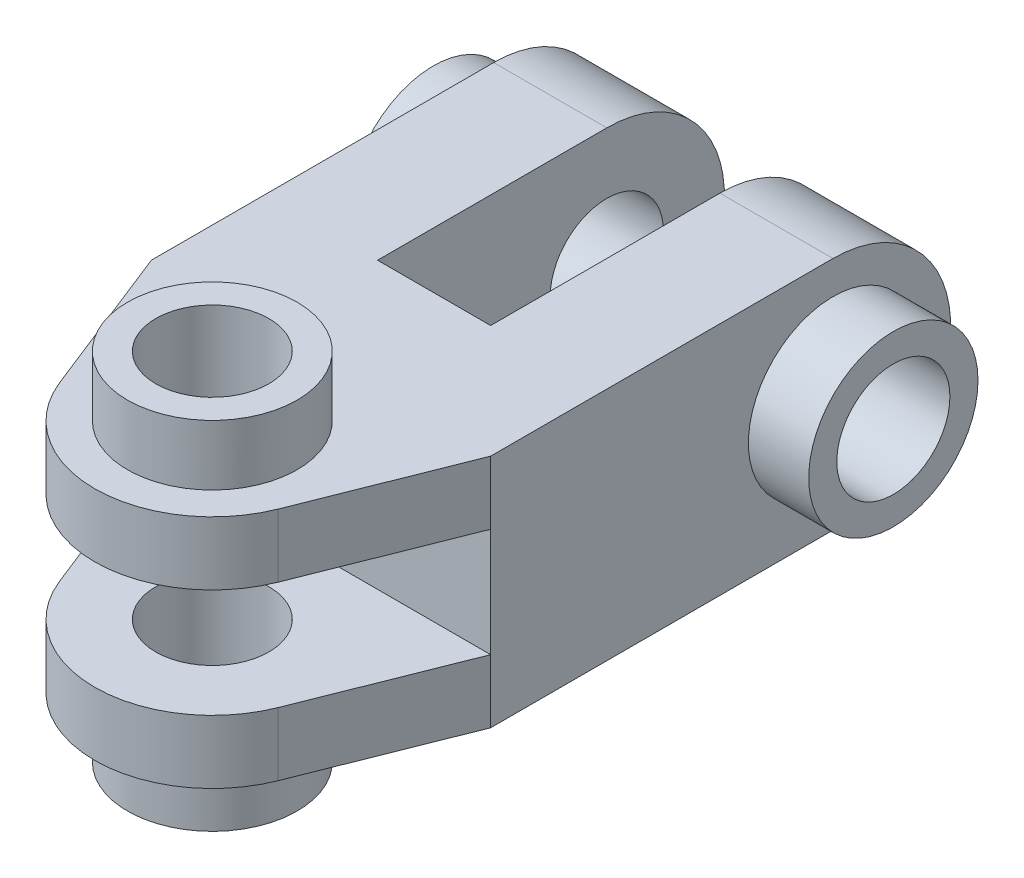
ISO-10303-21;
HEADER;
FILE_DESCRIPTION(('STEP AP214'),'2;1');
FILE_NAME('part.step','',(''),(''),'','','');
FILE_SCHEMA(('AUTOMOTIVE_DESIGN { 1 0 10303 214 1 1 1 1 }'));
ENDSEC;
DATA;
#1=APPLICATION_CONTEXT('core data for automotive mechanical design processes');
#2=APPLICATION_PROTOCOL_DEFINITION('international standard','automotive_design',2000,#1);
#3=PRODUCT_CONTEXT('',#1,'mechanical');
#4=PRODUCT('Part','Part','',(#3));
#5=PRODUCT_RELATED_PRODUCT_CATEGORY('part','',(#4));
#6=PRODUCT_DEFINITION_FORMATION('','',#4);
#7=PRODUCT_DEFINITION_CONTEXT('part definition',#1,'design');
#8=PRODUCT_DEFINITION('design','',#6,#7);
#9=PRODUCT_DEFINITION_SHAPE('','',#8);
#10=(LENGTH_UNIT() NAMED_UNIT(*) SI_UNIT(.MILLI.,.METRE.));
#11=(NAMED_UNIT(*) PLANE_ANGLE_UNIT() SI_UNIT($,.RADIAN.));
#12=(NAMED_UNIT(*) SI_UNIT($,.STERADIAN.) SOLID_ANGLE_UNIT());
#13=UNCERTAINTY_MEASURE_WITH_UNIT(LENGTH_MEASURE(1.E-05),#10,'distance_accuracy_value','');
#14=(GEOMETRIC_REPRESENTATION_CONTEXT(3) GLOBAL_UNCERTAINTY_ASSIGNED_CONTEXT((#13)) GLOBAL_UNIT_ASSIGNED_CONTEXT((#10,
#11,#12)) REPRESENTATION_CONTEXT('',''));
#15=CARTESIAN_POINT('',(0.,0.,0.));
#16=DIRECTION('',(0.,0.,1.));
#17=DIRECTION('',(1.,0.,0.));
#18=AXIS2_PLACEMENT_3D('',#15,#16,#17);
#19=CARTESIAN_POINT('',(28.575,0.,0.));
#20=DIRECTION('',(1.,0.,0.));
#21=DIRECTION('',(0.,0.,-1.));
#22=AXIS2_PLACEMENT_3D('',#19,#20,#21);
#23=PLANE('',#22);
#24=DIRECTION('',(0.,1.,0.));
#25=VECTOR('',#24,1.);
#26=CARTESIAN_POINT('',(28.575,-19.812,57.658));
#27=LINE('',#26,#25);
#28=CARTESIAN_POINT('',(28.575,-19.812,57.658));
#29=VERTEX_POINT('',#28);
#30=CARTESIAN_POINT('',(28.575,-9.144,57.658));
#31=VERTEX_POINT('',#30);
#32=EDGE_CURVE('E268',#29,#31,#27,.T.);
#33=ORIENTED_EDGE('',*,*,#32,.F.);
#34=DIRECTION('',(0.,0.,1.));
#35=VECTOR('',#34,1.);
#36=CARTESIAN_POINT('',(28.575,-19.812,0.));
#37=LINE('',#36,#35);
#38=CARTESIAN_POINT('',(28.575,-19.812,0.));
#39=VERTEX_POINT('',#38);
#40=EDGE_CURVE('E223',#39,#29,#37,.T.);
#41=ORIENTED_EDGE('',*,*,#40,.F.);
#42=CARTESIAN_POINT('',(28.575,0.,0.));
#43=DIRECTION('',(1.,0.,0.));
#44=DIRECTION('',(0.,0.,-1.));
#45=AXIS2_PLACEMENT_3D('',#42,#43,#44);
#46=CIRCLE('',#45,19.812);
#47=CARTESIAN_POINT('',(28.575,19.812,0.));
#48=VERTEX_POINT('',#47);
#49=EDGE_CURVE('E308',#39,#48,#46,.T.);
#50=ORIENTED_EDGE('',*,*,#49,.T.);
#51=DIRECTION('',(0.,0.,1.));
#52=VECTOR('',#51,1.);
#53=CARTESIAN_POINT('',(28.575,19.812,0.));
#54=LINE('',#53,#52);
#55=CARTESIAN_POINT('',(28.575,19.812,57.658));
#56=VERTEX_POINT('',#55);
#57=EDGE_CURVE('E310',#48,#56,#54,.T.);
#58=ORIENTED_EDGE('',*,*,#57,.T.);
#59=DIRECTION('',(0.,1.,0.));
#60=VECTOR('',#59,1.);
#61=CARTESIAN_POINT('',(28.575,0.,57.658));
#62=LINE('',#61,#60);
#63=CARTESIAN_POINT('',(28.575,9.144,57.658));
#64=VERTEX_POINT('',#63);
#65=EDGE_CURVE('E214',#64,#56,#62,.T.);
#66=ORIENTED_EDGE('',*,*,#65,.F.);
#67=DIRECTION('',(0.,-1.,0.));
#68=VECTOR('',#67,1.);
#69=CARTESIAN_POINT('',(28.575,0.,57.658));
#70=LINE('',#69,#68);
#71=EDGE_CURVE('E233',#64,#31,#70,.T.);
#72=ORIENTED_EDGE('',*,*,#71,.T.);
#73=EDGE_LOOP('',(#33,#41,#50,#58,#66,#72));
#74=FACE_BOUND('',#73,.T.);
#75=CARTESIAN_POINT('',(28.575,0.,0.));
#76=DIRECTION('',(1.,0.,0.));
#77=DIRECTION('',(0.,0.,-1.));
#78=AXIS2_PLACEMENT_3D('',#75,#76,#77);
#79=CIRCLE('',#78,14.25575);
#80=CARTESIAN_POINT('',(28.575,0.,-14.25575));
#81=VERTEX_POINT('',#80);
#82=EDGE_CURVE('E345',#81,#81,#79,.T.);
#83=ORIENTED_EDGE('',*,*,#82,.F.);
#84=EDGE_LOOP('',(#83));
#85=FACE_BOUND('',#84,.T.);
#86=ADVANCED_FACE('F89',(#74,#85),#23,.T.);
#87=CARTESIAN_POINT('',(28.575,-19.812,0.));
#88=DIRECTION('',(0.,-1.,0.));
#89=DIRECTION('',(0.,0.,-1.));
#90=AXIS2_PLACEMENT_3D('',#87,#88,#89);
#91=PLANE('',#90);
#92=CARTESIAN_POINT('',(-0.0154327730859556,-19.812,75.946));
#93=DIRECTION('',(0.,1.,0.));
#94=DIRECTION('',(0.,0.,1.));
#95=AXIS2_PLACEMENT_3D('',#92,#93,#94);
#96=CIRCLE('',#95,19.812);
#97=CARTESIAN_POINT('',(-18.4335789109401,-19.812,83.2458107403309));
#98=VERTEX_POINT('',#97);
#99=CARTESIAN_POINT('',(18.3950993167603,-19.812,83.2649925651515));
#100=VERTEX_POINT('',#99);
#101=EDGE_CURVE('E264',#98,#100,#96,.T.);
#102=ORIENTED_EDGE('',*,*,#101,.F.);
#103=DIRECTION('',(0.368454004660351,0.,0.929645979096209));
#104=VECTOR('',#103,1.);
#105=CARTESIAN_POINT('',(-44.4454026442376,-19.812,17.6154008743541));
#106=LINE('',#105,#104);
#107=CARTESIAN_POINT('',(-28.575,-19.812,57.6579999999999));
#108=VERTEX_POINT('',#107);
#109=EDGE_CURVE('E260',#108,#98,#106,.T.);
#110=ORIENTED_EDGE('',*,*,#109,.F.);
#111=DIRECTION('',(0.,0.,1.));
#112=VECTOR('',#111,1.);
#113=CARTESIAN_POINT('',(-28.575,-19.812,0.));
#114=LINE('',#113,#112);
#115=CARTESIAN_POINT('',(-28.575,-19.812,0.));
#116=VERTEX_POINT('',#115);
#117=EDGE_CURVE('E225',#116,#108,#114,.T.);
#118=ORIENTED_EDGE('',*,*,#117,.F.);
#119=DIRECTION('',(-1.,0.,0.));
#120=VECTOR('',#119,1.);
#121=CARTESIAN_POINT('',(28.575,-19.812,0.));
#122=LINE('',#121,#120);
#123=CARTESIAN_POINT('',(-9.52499999999999,-19.812,0.));
#124=VERTEX_POINT('',#123);
#125=EDGE_CURVE('E239',#124,#116,#122,.T.);
#126=ORIENTED_EDGE('',*,*,#125,.F.);
#127=DIRECTION('',(0.,0.,1.));
#128=VECTOR('',#127,1.);
#129=CARTESIAN_POINT('',(-9.52499999999999,-19.812,0.));
#130=LINE('',#129,#128);
#131=CARTESIAN_POINT('',(-9.52499999999999,-19.812,38.608));
#132=VERTEX_POINT('',#131);
#133=EDGE_CURVE('E290',#124,#132,#130,.T.);
#134=ORIENTED_EDGE('',*,*,#133,.T.);
#135=DIRECTION('',(1.,0.,0.));
#136=VECTOR('',#135,1.);
#137=CARTESIAN_POINT('',(0.,-19.812,38.608));
#138=LINE('',#137,#136);
#139=CARTESIAN_POINT('',(9.52500000000001,-19.812,38.608));
#140=VERTEX_POINT('',#139);
#141=EDGE_CURVE('E293',#132,#140,#138,.T.);
#142=ORIENTED_EDGE('',*,*,#141,.T.);
#143=DIRECTION('',(0.,0.,1.));
#144=VECTOR('',#143,1.);
#145=CARTESIAN_POINT('',(9.525,-19.812,0.));
#146=LINE('',#145,#144);
#147=CARTESIAN_POINT('',(9.525,-19.812,0.));
#148=VERTEX_POINT('',#147);
#149=EDGE_CURVE('E288',#148,#140,#146,.T.);
#150=ORIENTED_EDGE('',*,*,#149,.F.);
#151=EDGE_CURVE('E240',#39,#148,#122,.T.);
#152=ORIENTED_EDGE('',*,*,#151,.F.);
#153=ORIENTED_EDGE('',*,*,#40,.T.);
#154=DIRECTION('',(-0.369422196908513,0.,0.929261664135182));
#155=VECTOR('',#154,1.);
#156=CARTESIAN_POINT('',(44.4686991116195,-19.812,17.6782548484518));
#157=LINE('',#156,#155);
#158=EDGE_CURVE('E105',#29,#100,#157,.T.);
#159=ORIENTED_EDGE('',*,*,#158,.T.);
#160=EDGE_LOOP('',(#102,#110,#118,#126,#134,#142,#150,#152,#153,#159));
#161=FACE_BOUND('',#160,.T.);
#162=CARTESIAN_POINT('',(-0.0154327730859556,-19.812,75.946));
#163=DIRECTION('',(0.,-1.,0.));
#164=DIRECTION('',(0.,0.,-1.));
#165=AXIS2_PLACEMENT_3D('',#162,#163,#164);
#166=CIRCLE('',#165,14.2875);
#167=CARTESIAN_POINT('',(-0.0154327730859556,-19.812,61.6585));
#168=VERTEX_POINT('',#167);
#169=EDGE_CURVE('E334',#168,#168,#166,.T.);
#170=ORIENTED_EDGE('',*,*,#169,.F.);
#171=EDGE_LOOP('',(#170));
#172=FACE_BOUND('',#171,.T.);
#173=ADVANCED_FACE('F91',(#161,#172),#91,.T.);
#174=CARTESIAN_POINT('',(28.575,19.812,0.));
#175=DIRECTION('',(0.,-1.,0.));
#176=DIRECTION('',(0.,0.,-1.));
#177=AXIS2_PLACEMENT_3D('',#174,#175,#176);
#178=PLANE('',#177);
#179=DIRECTION('',(0.368454004660351,0.,0.929645979096209));
#180=VECTOR('',#179,1.);
#181=CARTESIAN_POINT('',(-44.4454026442376,19.812,17.6154008743541));
#182=LINE('',#181,#180);
#183=CARTESIAN_POINT('',(-28.575,19.812,57.6579999999999));
#184=VERTEX_POINT('',#183);
#185=CARTESIAN_POINT('',(-18.4335789109401,19.812,83.2458107403309));
#186=VERTEX_POINT('',#185);
#187=EDGE_CURVE('E192',#184,#186,#182,.T.);
#188=ORIENTED_EDGE('',*,*,#187,.T.);
#189=CARTESIAN_POINT('',(-0.0154327730859556,19.812,75.946));
#190=DIRECTION('',(0.,1.,0.));
#191=DIRECTION('',(0.,0.,1.));
#192=AXIS2_PLACEMENT_3D('',#189,#190,#191);
#193=CIRCLE('',#192,19.812);
#194=CARTESIAN_POINT('',(18.3950993167603,19.812,83.2649925651515));
#195=VERTEX_POINT('',#194);
#196=EDGE_CURVE('E255',#186,#195,#193,.T.);
#197=ORIENTED_EDGE('',*,*,#196,.T.);
#198=DIRECTION('',(-0.369422196908513,0.,0.929261664135182));
#199=VECTOR('',#198,1.);
#200=CARTESIAN_POINT('',(44.4686991116195,19.812,17.6782548484518));
#201=LINE('',#200,#199);
#202=EDGE_CURVE('E266',#56,#195,#201,.T.);
#203=ORIENTED_EDGE('',*,*,#202,.F.);
#204=ORIENTED_EDGE('',*,*,#57,.F.);
#205=DIRECTION('',(-1.,0.,0.));
#206=VECTOR('',#205,1.);
#207=CARTESIAN_POINT('',(28.575,19.812,0.));
#208=LINE('',#207,#206);
#209=CARTESIAN_POINT('',(9.525,19.812,0.));
#210=VERTEX_POINT('',#209);
#211=EDGE_CURVE('E236',#48,#210,#208,.T.);
#212=ORIENTED_EDGE('',*,*,#211,.T.);
#213=DIRECTION('',(0.,0.,-1.));
#214=VECTOR('',#213,1.);
#215=CARTESIAN_POINT('',(9.525,19.812,0.));
#216=LINE('',#215,#214);
#217=CARTESIAN_POINT('',(9.52500000000001,19.812,38.608));
#218=VERTEX_POINT('',#217);
#219=EDGE_CURVE('E245',#218,#210,#216,.T.);
#220=ORIENTED_EDGE('',*,*,#219,.F.);
#221=DIRECTION('',(1.,0.,0.));
#222=VECTOR('',#221,1.);
#223=CARTESIAN_POINT('',(0.,19.812,38.608));
#224=LINE('',#223,#222);
#225=CARTESIAN_POINT('',(-9.52499999999999,19.812,38.608));
#226=VERTEX_POINT('',#225);
#227=EDGE_CURVE('E287',#226,#218,#224,.T.);
#228=ORIENTED_EDGE('',*,*,#227,.F.);
#229=DIRECTION('',(0.,0.,-1.));
#230=VECTOR('',#229,1.);
#231=CARTESIAN_POINT('',(-9.525,19.812,0.));
#232=LINE('',#231,#230);
#233=CARTESIAN_POINT('',(-9.525,19.812,0.));
#234=VERTEX_POINT('',#233);
#235=EDGE_CURVE('E243',#226,#234,#232,.T.);
#236=ORIENTED_EDGE('',*,*,#235,.T.);
#237=CARTESIAN_POINT('',(-28.575,19.812,0.));
#238=VERTEX_POINT('',#237);
#239=EDGE_CURVE('E219',#234,#238,#208,.T.);
#240=ORIENTED_EDGE('',*,*,#239,.T.);
#241=DIRECTION('',(0.,0.,1.));
#242=VECTOR('',#241,1.);
#243=CARTESIAN_POINT('',(-28.575,19.812,0.));
#244=LINE('',#243,#242);
#245=EDGE_CURVE('E210',#238,#184,#244,.T.);
#246=ORIENTED_EDGE('',*,*,#245,.T.);
#247=EDGE_LOOP('',(#188,#197,#203,#204,#212,#220,#228,#236,#240,#246));
#248=FACE_BOUND('',#247,.T.);
#249=CARTESIAN_POINT('',(-0.0154327730859556,19.812,75.946));
#250=DIRECTION('',(0.,-1.,0.));
#251=DIRECTION('',(0.,0.,-1.));
#252=AXIS2_PLACEMENT_3D('',#249,#250,#251);
#253=CIRCLE('',#252,14.2875);
#254=CARTESIAN_POINT('',(-0.0154327730859556,19.812,61.6585));
#255=VERTEX_POINT('',#254);
#256=EDGE_CURVE('E12',#255,#255,#253,.F.);
#257=ORIENTED_EDGE('',*,*,#256,.F.);
#258=EDGE_LOOP('',(#257));
#259=FACE_BOUND('',#258,.T.);
#260=ADVANCED_FACE('F216',(#248,#259),#178,.F.);
#261=CARTESIAN_POINT('',(28.575,9.144,0.));
#262=DIRECTION('',(0.,1.,0.));
#263=DIRECTION('',(0.,0.,1.));
#264=AXIS2_PLACEMENT_3D('',#261,#262,#263);
#265=PLANE('',#264);
#266=CARTESIAN_POINT('',(-0.0154327730859556,9.144,75.946));
#267=DIRECTION('',(0.,1.,0.));
#268=DIRECTION('',(0.,0.,1.));
#269=AXIS2_PLACEMENT_3D('',#266,#267,#268);
#270=CIRCLE('',#269,9.525);
#271=CARTESIAN_POINT('',(-0.0154327730859556,9.144,85.471));
#272=VERTEX_POINT('',#271);
#273=EDGE_CURVE('E250',#272,#272,#270,.T.);
#274=ORIENTED_EDGE('',*,*,#273,.T.);
#275=EDGE_LOOP('',(#274));
#276=FACE_BOUND('',#275,.T.);
#277=CARTESIAN_POINT('',(-0.0154327730859556,9.144,75.946));
#278=DIRECTION('',(0.,1.,0.));
#279=DIRECTION('',(0.,0.,1.));
#280=AXIS2_PLACEMENT_3D('',#277,#278,#279);
#281=CIRCLE('',#280,19.812);
#282=CARTESIAN_POINT('',(-18.4335789109401,9.144,83.2458107403309));
#283=VERTEX_POINT('',#282);
#284=CARTESIAN_POINT('',(18.3950993167603,9.144,83.2649925651515));
#285=VERTEX_POINT('',#284);
#286=EDGE_CURVE('E285',#283,#285,#281,.T.);
#287=ORIENTED_EDGE('',*,*,#286,.F.);
#288=DIRECTION('',(0.368454004660351,0.,0.92964597909621));
#289=VECTOR('',#288,1.);
#290=CARTESIAN_POINT('',(-40.5661076915392,9.144,27.4032465997078));
#291=LINE('',#290,#289);
#292=CARTESIAN_POINT('',(-28.575,9.144,57.6579999999999));
#293=VERTEX_POINT('',#292);
#294=EDGE_CURVE('E251',#293,#283,#291,.T.);
#295=ORIENTED_EDGE('',*,*,#294,.F.);
#296=DIRECTION('',(-1.,0.,0.));
#297=VECTOR('',#296,1.);
#298=CARTESIAN_POINT('',(28.575,9.144,57.658));
#299=LINE('',#298,#297);
#300=EDGE_CURVE('E232',#64,#293,#299,.T.);
#301=ORIENTED_EDGE('',*,*,#300,.F.);
#302=DIRECTION('',(-0.369422196908513,0.,0.929261664135182));
#303=VECTOR('',#302,1.);
#304=CARTESIAN_POINT('',(48.3684082162955,9.144,7.86874637121282));
#305=LINE('',#304,#303);
#306=EDGE_CURVE('E279',#64,#285,#305,.T.);
#307=ORIENTED_EDGE('',*,*,#306,.T.);
#308=EDGE_LOOP('',(#287,#295,#301,#307));
#309=FACE_BOUND('',#308,.T.);
#310=ADVANCED_FACE('F403',(#276,#309),#265,.F.);
#311=CARTESIAN_POINT('',(28.575,-9.144,0.));
#312=DIRECTION('',(0.,1.,0.));
#313=DIRECTION('',(0.,0.,1.));
#314=AXIS2_PLACEMENT_3D('',#311,#312,#313);
#315=PLANE('',#314);
#316=CARTESIAN_POINT('',(-0.0154327730859556,-9.144,75.946));
#317=DIRECTION('',(0.,1.,0.));
#318=DIRECTION('',(0.,0.,1.));
#319=AXIS2_PLACEMENT_3D('',#316,#317,#318);
#320=CIRCLE('',#319,9.525);
#321=CARTESIAN_POINT('',(-0.0154327730859556,-9.144,85.471));
#322=VERTEX_POINT('',#321);
#323=EDGE_CURVE('E248',#322,#322,#320,.T.);
#324=ORIENTED_EDGE('',*,*,#323,.F.);
#325=EDGE_LOOP('',(#324));
#326=FACE_BOUND('',#325,.T.);
#327=DIRECTION('',(0.368454004660351,0.,0.92964597909621));
#328=VECTOR('',#327,1.);
#329=CARTESIAN_POINT('',(-40.5661076915392,-9.144,27.4032465997078));
#330=LINE('',#329,#328);
#331=CARTESIAN_POINT('',(-28.575,-9.144,57.6579999999999));
#332=VERTEX_POINT('',#331);
#333=CARTESIAN_POINT('',(-18.4335789109401,-9.144,83.2458107403309));
#334=VERTEX_POINT('',#333);
#335=EDGE_CURVE('E257',#332,#334,#330,.T.);
#336=ORIENTED_EDGE('',*,*,#335,.T.);
#337=CARTESIAN_POINT('',(-0.0154327730859556,-9.144,75.946));
#338=DIRECTION('',(0.,1.,0.));
#339=DIRECTION('',(0.,0.,1.));
#340=AXIS2_PLACEMENT_3D('',#337,#338,#339);
#341=CIRCLE('',#340,19.812);
#342=CARTESIAN_POINT('',(18.3950993167603,-9.144,83.2649925651515));
#343=VERTEX_POINT('',#342);
#344=EDGE_CURVE('E282',#334,#343,#341,.T.);
#345=ORIENTED_EDGE('',*,*,#344,.T.);
#346=DIRECTION('',(-0.369422196908513,0.,0.929261664135182));
#347=VECTOR('',#346,1.);
#348=CARTESIAN_POINT('',(48.3684082162955,-9.144,7.86874637121282));
#349=LINE('',#348,#347);
#350=EDGE_CURVE('E275',#31,#343,#349,.T.);
#351=ORIENTED_EDGE('',*,*,#350,.F.);
#352=DIRECTION('',(-1.,0.,0.));
#353=VECTOR('',#352,1.);
#354=CARTESIAN_POINT('',(28.575,-9.144,57.658));
#355=LINE('',#354,#353);
#356=EDGE_CURVE('E229',#31,#332,#355,.T.);
#357=ORIENTED_EDGE('',*,*,#356,.T.);
#358=EDGE_LOOP('',(#336,#345,#351,#357));
#359=FACE_BOUND('',#358,.T.);
#360=ADVANCED_FACE('F399',(#326,#359),#315,.T.);
#361=CARTESIAN_POINT('',(-28.575,0.,0.));
#362=DIRECTION('',(1.,0.,0.));
#363=DIRECTION('',(0.,0.,-1.));
#364=AXIS2_PLACEMENT_3D('',#361,#362,#363);
#365=PLANE('',#364);
#366=CARTESIAN_POINT('',(-28.575,0.,0.));
#367=DIRECTION('',(1.,0.,0.));
#368=DIRECTION('',(0.,0.,-1.));
#369=AXIS2_PLACEMENT_3D('',#366,#367,#368);
#370=CIRCLE('',#369,14.25575);
#371=CARTESIAN_POINT('',(-28.575,0.,-14.25575));
#372=VERTEX_POINT('',#371);
#373=EDGE_CURVE('E355',#372,#372,#370,.T.);
#374=ORIENTED_EDGE('',*,*,#373,.T.);
#375=EDGE_LOOP('',(#374));
#376=FACE_BOUND('',#375,.T.);
#377=DIRECTION('',(0.,-1.,0.));
#378=VECTOR('',#377,1.);
#379=CARTESIAN_POINT('',(-28.575,0.,57.658));
#380=LINE('',#379,#378);
#381=EDGE_CURVE('E98',#184,#293,#380,.T.);
#382=ORIENTED_EDGE('',*,*,#381,.F.);
#383=ORIENTED_EDGE('',*,*,#245,.F.);
#384=CARTESIAN_POINT('',(-28.575,0.,0.));
#385=DIRECTION('',(1.,0.,0.));
#386=DIRECTION('',(0.,0.,-1.));
#387=AXIS2_PLACEMENT_3D('',#384,#385,#386);
#388=CIRCLE('',#387,19.812);
#389=EDGE_CURVE('E221',#116,#238,#388,.T.);
#390=ORIENTED_EDGE('',*,*,#389,.F.);
#391=ORIENTED_EDGE('',*,*,#117,.T.);
#392=DIRECTION('',(0.,1.,0.));
#393=VECTOR('',#392,1.);
#394=CARTESIAN_POINT('',(-28.575,-19.812,57.6579999999999));
#395=LINE('',#394,#393);
#396=EDGE_CURVE('E202',#108,#332,#395,.T.);
#397=ORIENTED_EDGE('',*,*,#396,.T.);
#398=DIRECTION('',(0.,-1.,0.));
#399=VECTOR('',#398,1.);
#400=CARTESIAN_POINT('',(-28.575,0.,57.658));
#401=LINE('',#400,#399);
#402=EDGE_CURVE('E213',#293,#332,#401,.T.);
#403=ORIENTED_EDGE('',*,*,#402,.F.);
#404=EDGE_LOOP('',(#382,#383,#390,#391,#397,#403));
#405=FACE_BOUND('',#404,.T.);
#406=ADVANCED_FACE('F208',(#376,#405),#365,.F.);
#407=CARTESIAN_POINT('',(28.575,0.,0.));
#408=DIRECTION('',(-1.,0.,0.));
#409=DIRECTION('',(0.,0.,1.));
#410=AXIS2_PLACEMENT_3D('',#407,#408,#409);
#411=CYLINDRICAL_SURFACE('',#410,19.812);
#412=CARTESIAN_POINT('',(9.525,0.,0.));
#413=DIRECTION('',(-1.,0.,0.));
#414=DIRECTION('',(0.,0.,1.));
#415=AXIS2_PLACEMENT_3D('',#412,#413,#414);
#416=CIRCLE('',#415,19.812);
#417=EDGE_CURVE('E304',#210,#148,#416,.T.);
#418=ORIENTED_EDGE('',*,*,#417,.F.);
#419=ORIENTED_EDGE('',*,*,#211,.F.);
#420=ORIENTED_EDGE('',*,*,#49,.F.);
#421=ORIENTED_EDGE('',*,*,#151,.T.);
#422=EDGE_LOOP('',(#418,#419,#420,#421));
#423=FACE_BOUND('',#422,.T.);
#424=ADVANCED_FACE('F398',(#423),#411,.T.);
#425=ORIENTED_EDGE('',*,*,#239,.F.);
#426=CARTESIAN_POINT('',(-9.525,0.,0.));
#427=DIRECTION('',(-1.,0.,0.));
#428=DIRECTION('',(0.,0.,1.));
#429=AXIS2_PLACEMENT_3D('',#426,#427,#428);
#430=CIRCLE('',#429,19.812);
#431=EDGE_CURVE('E113',#234,#124,#430,.T.);
#432=ORIENTED_EDGE('',*,*,#431,.T.);
#433=ORIENTED_EDGE('',*,*,#125,.T.);
#434=ORIENTED_EDGE('',*,*,#389,.T.);
#435=EDGE_LOOP('',(#425,#432,#433,#434));
#436=FACE_BOUND('',#435,.T.);
#437=ADVANCED_FACE('F408',(#436),#411,.T.);
#438=CARTESIAN_POINT('',(28.575,0.,57.658));
#439=DIRECTION('',(0.,0.,-1.));
#440=DIRECTION('',(-1.,0.,0.));
#441=AXIS2_PLACEMENT_3D('',#438,#439,#440);
#442=PLANE('',#441);
#443=ORIENTED_EDGE('',*,*,#402,.T.);
#444=ORIENTED_EDGE('',*,*,#356,.F.);
#445=ORIENTED_EDGE('',*,*,#71,.F.);
#446=ORIENTED_EDGE('',*,*,#300,.T.);
#447=EDGE_LOOP('',(#443,#444,#445,#446));
#448=FACE_BOUND('',#447,.T.);
#449=ADVANCED_FACE('F405',(#448),#442,.F.);
#450=CARTESIAN_POINT('',(9.525,-19.812,0.));
#451=DIRECTION('',(-1.,0.,0.));
#452=DIRECTION('',(0.,0.,1.));
#453=AXIS2_PLACEMENT_3D('',#450,#451,#452);
#454=PLANE('',#453);
#455=CARTESIAN_POINT('',(9.525,0.,0.));
#456=DIRECTION('',(-1.,0.,0.));
#457=DIRECTION('',(0.,0.,1.));
#458=AXIS2_PLACEMENT_3D('',#455,#456,#457);
#459=CIRCLE('',#458,9.525);
#460=CARTESIAN_POINT('',(9.525,0.,9.525));
#461=VERTEX_POINT('',#460);
#462=EDGE_CURVE('E342',#461,#461,#459,.T.);
#463=ORIENTED_EDGE('',*,*,#462,.F.);
#464=EDGE_LOOP('',(#463));
#465=FACE_BOUND('',#464,.T.);
#466=ORIENTED_EDGE('',*,*,#417,.T.);
#467=ORIENTED_EDGE('',*,*,#149,.T.);
#468=DIRECTION('',(0.,1.,0.));
#469=VECTOR('',#468,1.);
#470=CARTESIAN_POINT('',(9.52500000000001,-19.812,38.608));
#471=LINE('',#470,#469);
#472=EDGE_CURVE('E299',#140,#218,#471,.T.);
#473=ORIENTED_EDGE('',*,*,#472,.T.);
#474=ORIENTED_EDGE('',*,*,#219,.T.);
#475=EDGE_LOOP('',(#466,#467,#473,#474));
#476=FACE_BOUND('',#475,.T.);
#477=ADVANCED_FACE('F394',(#465,#476),#454,.T.);
#478=CARTESIAN_POINT('',(-9.52499999999999,-19.812,0.));
#479=DIRECTION('',(-1.,0.,0.));
#480=DIRECTION('',(0.,0.,1.));
#481=AXIS2_PLACEMENT_3D('',#478,#479,#480);
#482=PLANE('',#481);
#483=CARTESIAN_POINT('',(-9.525,0.,0.));
#484=DIRECTION('',(-1.,0.,0.));
#485=DIRECTION('',(0.,0.,1.));
#486=AXIS2_PLACEMENT_3D('',#483,#484,#485);
#487=CIRCLE('',#486,9.525);
#488=CARTESIAN_POINT('',(-9.525,0.,9.525));
#489=VERTEX_POINT('',#488);
#490=EDGE_CURVE('E93',#489,#489,#487,.T.);
#491=ORIENTED_EDGE('',*,*,#490,.T.);
#492=EDGE_LOOP('',(#491));
#493=FACE_BOUND('',#492,.T.);
#494=ORIENTED_EDGE('',*,*,#235,.F.);
#495=DIRECTION('',(0.,1.,0.));
#496=VECTOR('',#495,1.);
#497=CARTESIAN_POINT('',(-9.52499999999999,-19.812,38.608));
#498=LINE('',#497,#496);
#499=EDGE_CURVE('E296',#132,#226,#498,.T.);
#500=ORIENTED_EDGE('',*,*,#499,.F.);
#501=ORIENTED_EDGE('',*,*,#133,.F.);
#502=ORIENTED_EDGE('',*,*,#431,.F.);
#503=EDGE_LOOP('',(#494,#500,#501,#502));
#504=FACE_BOUND('',#503,.T.);
#505=ADVANCED_FACE('F436',(#493,#504),#482,.F.);
#506=CARTESIAN_POINT('',(0.,-19.812,38.608));
#507=DIRECTION('',(0.,0.,1.));
#508=DIRECTION('',(0.,-1.,0.));
#509=AXIS2_PLACEMENT_3D('',#506,#507,#508);
#510=PLANE('',#509);
#511=ORIENTED_EDGE('',*,*,#227,.T.);
#512=ORIENTED_EDGE('',*,*,#472,.F.);
#513=ORIENTED_EDGE('',*,*,#141,.F.);
#514=ORIENTED_EDGE('',*,*,#499,.T.);
#515=EDGE_LOOP('',(#511,#512,#513,#514));
#516=FACE_BOUND('',#515,.T.);
#517=ADVANCED_FACE('F435',(#516),#510,.F.);
#518=CARTESIAN_POINT('',(44.4686991116195,-19.812,17.6782548484518));
#519=DIRECTION('',(-0.929261664135182,0.,-0.369422196908513));
#520=DIRECTION('',(-0.369422196908513,0.,0.929261664135182));
#521=AXIS2_PLACEMENT_3D('',#518,#519,#520);
#522=PLANE('',#521);
#523=ORIENTED_EDGE('',*,*,#65,.T.);
#524=ORIENTED_EDGE('',*,*,#202,.T.);
#525=DIRECTION('',(0.,1.,0.));
#526=VECTOR('',#525,1.);
#527=CARTESIAN_POINT('',(18.3950993167603,-19.812,83.2649925651515));
#528=LINE('',#527,#526);
#529=EDGE_CURVE('E276',#285,#195,#528,.T.);
#530=ORIENTED_EDGE('',*,*,#529,.F.);
#531=ORIENTED_EDGE('',*,*,#306,.F.);
#532=EDGE_LOOP('',(#523,#524,#530,#531));
#533=FACE_BOUND('',#532,.T.);
#534=ADVANCED_FACE('F443',(#533),#522,.F.);
#535=CARTESIAN_POINT('',(-0.0154327730859556,-19.812,75.946));
#536=DIRECTION('',(0.,1.,0.));
#537=DIRECTION('',(0.,0.,1.));
#538=AXIS2_PLACEMENT_3D('',#535,#536,#537);
#539=CYLINDRICAL_SURFACE('',#538,19.812);
#540=ORIENTED_EDGE('',*,*,#286,.T.);
#541=ORIENTED_EDGE('',*,*,#529,.T.);
#542=ORIENTED_EDGE('',*,*,#196,.F.);
#543=DIRECTION('',(0.,1.,0.));
#544=VECTOR('',#543,1.);
#545=CARTESIAN_POINT('',(-18.4335789109401,-19.812,83.2458107403309));
#546=LINE('',#545,#544);
#547=EDGE_CURVE('E198',#283,#186,#546,.T.);
#548=ORIENTED_EDGE('',*,*,#547,.F.);
#549=EDGE_LOOP('',(#540,#541,#542,#548));
#550=FACE_BOUND('',#549,.T.);
#551=ADVANCED_FACE('F452',(#550),#539,.T.);
#552=ORIENTED_EDGE('',*,*,#344,.F.);
#553=EDGE_CURVE('E203',#98,#334,#546,.T.);
#554=ORIENTED_EDGE('',*,*,#553,.F.);
#555=ORIENTED_EDGE('',*,*,#101,.T.);
#556=EDGE_CURVE('E272',#100,#343,#528,.T.);
#557=ORIENTED_EDGE('',*,*,#556,.T.);
#558=EDGE_LOOP('',(#552,#554,#555,#557));
#559=FACE_BOUND('',#558,.T.);
#560=ADVANCED_FACE('F448',(#559),#539,.T.);
#561=ORIENTED_EDGE('',*,*,#350,.T.);
#562=ORIENTED_EDGE('',*,*,#556,.F.);
#563=ORIENTED_EDGE('',*,*,#158,.F.);
#564=ORIENTED_EDGE('',*,*,#32,.T.);
#565=EDGE_LOOP('',(#561,#562,#563,#564));
#566=FACE_BOUND('',#565,.T.);
#567=ADVANCED_FACE('F451',(#566),#522,.F.);
#568=CARTESIAN_POINT('',(-0.0154327730859556,-19.812,75.946));
#569=DIRECTION('',(0.,1.,0.));
#570=DIRECTION('',(0.,0.,1.));
#571=AXIS2_PLACEMENT_3D('',#568,#569,#570);
#572=CYLINDRICAL_SURFACE('',#571,9.525);
#573=ORIENTED_EDGE('',*,*,#323,.T.);
#574=EDGE_LOOP('',(#573));
#575=FACE_BOUND('',#574,.T.);
#576=CARTESIAN_POINT('',(-0.0154327730859556,-29.972,75.946));
#577=DIRECTION('',(0.,-1.,0.));
#578=DIRECTION('',(0.,0.,-1.));
#579=AXIS2_PLACEMENT_3D('',#576,#577,#578);
#580=CIRCLE('',#579,9.52500000000001);
#581=CARTESIAN_POINT('',(-0.0154327730859556,-29.972,66.421));
#582=VERTEX_POINT('',#581);
#583=EDGE_CURVE('E337',#582,#582,#580,.T.);
#584=ORIENTED_EDGE('',*,*,#583,.T.);
#585=EDGE_LOOP('',(#584));
#586=FACE_BOUND('',#585,.T.);
#587=ADVANCED_FACE('F456',(#575,#586),#572,.F.);
#588=ORIENTED_EDGE('',*,*,#273,.F.);
#589=EDGE_LOOP('',(#588));
#590=FACE_BOUND('',#589,.T.);
#591=CARTESIAN_POINT('',(-0.0154327730859556,29.972,75.946));
#592=DIRECTION('',(0.,1.,0.));
#593=DIRECTION('',(0.,0.,1.));
#594=AXIS2_PLACEMENT_3D('',#591,#592,#593);
#595=CIRCLE('',#594,9.52500000000001);
#596=CARTESIAN_POINT('',(-0.0154327730859556,29.972,85.471));
#597=VERTEX_POINT('',#596);
#598=EDGE_CURVE('E330',#597,#597,#595,.T.);
#599=ORIENTED_EDGE('',*,*,#598,.T.);
#600=EDGE_LOOP('',(#599));
#601=FACE_BOUND('',#600,.T.);
#602=ADVANCED_FACE('F459',(#590,#601),#572,.F.);
#603=CARTESIAN_POINT('',(-44.4454026442376,-19.812,17.6154008743541));
#604=DIRECTION('',(-0.929645979096209,0.,0.368454004660351));
#605=DIRECTION('',(0.368454004660351,0.,0.92964597909621));
#606=AXIS2_PLACEMENT_3D('',#603,#604,#605);
#607=PLANE('',#606);
#608=ORIENTED_EDGE('',*,*,#396,.F.);
#609=ORIENTED_EDGE('',*,*,#109,.T.);
#610=ORIENTED_EDGE('',*,*,#553,.T.);
#611=ORIENTED_EDGE('',*,*,#335,.F.);
#612=EDGE_LOOP('',(#608,#609,#610,#611));
#613=FACE_BOUND('',#612,.T.);
#614=ADVANCED_FACE('F460',(#613),#607,.T.);
#615=ORIENTED_EDGE('',*,*,#294,.T.);
#616=ORIENTED_EDGE('',*,*,#547,.T.);
#617=ORIENTED_EDGE('',*,*,#187,.F.);
#618=ORIENTED_EDGE('',*,*,#381,.T.);
#619=EDGE_LOOP('',(#615,#616,#617,#618));
#620=FACE_BOUND('',#619,.T.);
#621=ADVANCED_FACE('F195',(#620),#607,.T.);
#622=CARTESIAN_POINT('',(-0.0154327730859556,29.972,75.946));
#623=DIRECTION('',(0.,1.,0.));
#624=DIRECTION('',(0.,0.,1.));
#625=AXIS2_PLACEMENT_3D('',#622,#623,#624);
#626=PLANE('',#625);
#627=CARTESIAN_POINT('',(-0.0154327730859556,29.972,75.946));
#628=DIRECTION('',(0.,1.,0.));
#629=DIRECTION('',(0.,0.,1.));
#630=AXIS2_PLACEMENT_3D('',#627,#628,#629);
#631=CIRCLE('',#630,14.2875);
#632=CARTESIAN_POINT('',(-0.0154327730859556,29.972,90.2335));
#633=VERTEX_POINT('',#632);
#634=EDGE_CURVE('E327',#633,#633,#631,.T.);
#635=ORIENTED_EDGE('',*,*,#634,.T.);
#636=EDGE_LOOP('',(#635));
#637=FACE_BOUND('',#636,.T.);
#638=ORIENTED_EDGE('',*,*,#598,.F.);
#639=EDGE_LOOP('',(#638));
#640=FACE_BOUND('',#639,.T.);
#641=ADVANCED_FACE('F466',(#637,#640),#626,.T.);
#642=CARTESIAN_POINT('',(-0.0154327730859556,29.972,75.946));
#643=DIRECTION('',(0.,-1.,0.));
#644=DIRECTION('',(0.,0.,-1.));
#645=AXIS2_PLACEMENT_3D('',#642,#643,#644);
#646=CYLINDRICAL_SURFACE('',#645,14.2875);
#647=ORIENTED_EDGE('',*,*,#634,.F.);
#648=EDGE_LOOP('',(#647));
#649=FACE_BOUND('',#648,.T.);
#650=ORIENTED_EDGE('',*,*,#256,.T.);
#651=EDGE_LOOP('',(#650));
#652=FACE_BOUND('',#651,.T.);
#653=ADVANCED_FACE('F463',(#649,#652),#646,.T.);
#654=CARTESIAN_POINT('',(-0.0154327730859556,-29.972,75.946));
#655=DIRECTION('',(0.,-1.,0.));
#656=DIRECTION('',(0.,0.,-1.));
#657=AXIS2_PLACEMENT_3D('',#654,#655,#656);
#658=PLANE('',#657);
#659=CARTESIAN_POINT('',(-0.0154327730859556,-29.972,75.946));
#660=DIRECTION('',(0.,-1.,0.));
#661=DIRECTION('',(0.,0.,-1.));
#662=AXIS2_PLACEMENT_3D('',#659,#660,#661);
#663=CIRCLE('',#662,14.2875);
#664=CARTESIAN_POINT('',(-0.0154327730859556,-29.972,61.6585));
#665=VERTEX_POINT('',#664);
#666=EDGE_CURVE('E333',#665,#665,#663,.T.);
#667=ORIENTED_EDGE('',*,*,#666,.T.);
#668=EDGE_LOOP('',(#667));
#669=FACE_BOUND('',#668,.T.);
#670=ORIENTED_EDGE('',*,*,#583,.F.);
#671=EDGE_LOOP('',(#670));
#672=FACE_BOUND('',#671,.T.);
#673=ADVANCED_FACE('F379',(#669,#672),#658,.T.);
#674=CARTESIAN_POINT('',(-0.0154327730859556,-29.972,75.946));
#675=DIRECTION('',(0.,1.,0.));
#676=DIRECTION('',(0.,0.,1.));
#677=AXIS2_PLACEMENT_3D('',#674,#675,#676);
#678=CYLINDRICAL_SURFACE('',#677,14.2875);
#679=ORIENTED_EDGE('',*,*,#666,.F.);
#680=EDGE_LOOP('',(#679));
#681=FACE_BOUND('',#680,.T.);
#682=ORIENTED_EDGE('',*,*,#169,.T.);
#683=EDGE_LOOP('',(#682));
#684=FACE_BOUND('',#683,.T.);
#685=ADVANCED_FACE('F370',(#681,#684),#678,.T.);
#686=CARTESIAN_POINT('',(-28.575,0.,0.));
#687=DIRECTION('',(1.,0.,0.));
#688=DIRECTION('',(0.,0.,-1.));
#689=AXIS2_PLACEMENT_3D('',#686,#687,#688);
#690=CYLINDRICAL_SURFACE('',#689,9.525);
#691=ORIENTED_EDGE('',*,*,#490,.F.);
#692=EDGE_LOOP('',(#691));
#693=FACE_BOUND('',#692,.T.);
#694=CARTESIAN_POINT('',(-38.735,0.,0.));
#695=DIRECTION('',(1.,0.,0.));
#696=DIRECTION('',(0.,0.,-1.));
#697=AXIS2_PLACEMENT_3D('',#694,#695,#696);
#698=CIRCLE('',#697,9.525);
#699=CARTESIAN_POINT('',(-38.735,0.,-9.525));
#700=VERTEX_POINT('',#699);
#701=EDGE_CURVE('E358',#700,#700,#698,.T.);
#702=ORIENTED_EDGE('',*,*,#701,.F.);
#703=EDGE_LOOP('',(#702));
#704=FACE_BOUND('',#703,.T.);
#705=ADVANCED_FACE('F367',(#693,#704),#690,.F.);
#706=ORIENTED_EDGE('',*,*,#462,.T.);
#707=EDGE_LOOP('',(#706));
#708=FACE_BOUND('',#707,.T.);
#709=CARTESIAN_POINT('',(38.735,0.,0.));
#710=DIRECTION('',(1.,0.,0.));
#711=DIRECTION('',(0.,0.,-1.));
#712=AXIS2_PLACEMENT_3D('',#709,#710,#711);
#713=CIRCLE('',#712,9.525);
#714=CARTESIAN_POINT('',(38.735,0.,-9.525));
#715=VERTEX_POINT('',#714);
#716=EDGE_CURVE('E349',#715,#715,#713,.T.);
#717=ORIENTED_EDGE('',*,*,#716,.T.);
#718=EDGE_LOOP('',(#717));
#719=FACE_BOUND('',#718,.T.);
#720=ADVANCED_FACE('F369',(#708,#719),#690,.F.);
#721=CARTESIAN_POINT('',(38.735,0.,0.));
#722=DIRECTION('',(1.,0.,0.));
#723=DIRECTION('',(0.,0.,-1.));
#724=AXIS2_PLACEMENT_3D('',#721,#722,#723);
#725=PLANE('',#724);
#726=CARTESIAN_POINT('',(38.735,0.,0.));
#727=DIRECTION('',(1.,0.,0.));
#728=DIRECTION('',(0.,0.,-1.));
#729=AXIS2_PLACEMENT_3D('',#726,#727,#728);
#730=CIRCLE('',#729,14.25575);
#731=CARTESIAN_POINT('',(38.735,0.,-14.25575));
#732=VERTEX_POINT('',#731);
#733=EDGE_CURVE('E348',#732,#732,#730,.T.);
#734=ORIENTED_EDGE('',*,*,#733,.T.);
#735=EDGE_LOOP('',(#734));
#736=FACE_BOUND('',#735,.T.);
#737=ORIENTED_EDGE('',*,*,#716,.F.);
#738=EDGE_LOOP('',(#737));
#739=FACE_BOUND('',#738,.T.);
#740=ADVANCED_FACE('F377',(#736,#739),#725,.T.);
#741=CARTESIAN_POINT('',(38.735,0.,0.));
#742=DIRECTION('',(-1.,0.,0.));
#743=DIRECTION('',(0.,0.,1.));
#744=AXIS2_PLACEMENT_3D('',#741,#742,#743);
#745=CYLINDRICAL_SURFACE('',#744,14.25575);
#746=ORIENTED_EDGE('',*,*,#733,.F.);
#747=EDGE_LOOP('',(#746));
#748=FACE_BOUND('',#747,.T.);
#749=ORIENTED_EDGE('',*,*,#82,.T.);
#750=EDGE_LOOP('',(#749));
#751=FACE_BOUND('',#750,.T.);
#752=ADVANCED_FACE('F521',(#748,#751),#745,.T.);
#753=CARTESIAN_POINT('',(-38.735,0.,0.));
#754=DIRECTION('',(1.,0.,0.));
#755=DIRECTION('',(0.,0.,-1.));
#756=AXIS2_PLACEMENT_3D('',#753,#754,#755);
#757=CYLINDRICAL_SURFACE('',#756,14.25575);
#758=CARTESIAN_POINT('',(-38.735,0.,0.));
#759=DIRECTION('',(1.,0.,0.));
#760=DIRECTION('',(0.,0.,-1.));
#761=AXIS2_PLACEMENT_3D('',#758,#759,#760);
#762=CIRCLE('',#761,14.25575);
#763=CARTESIAN_POINT('',(-38.735,0.,-14.25575));
#764=VERTEX_POINT('',#763);
#765=EDGE_CURVE('E354',#764,#764,#762,.T.);
#766=ORIENTED_EDGE('',*,*,#765,.T.);
#767=EDGE_LOOP('',(#766));
#768=FACE_BOUND('',#767,.T.);
#769=ORIENTED_EDGE('',*,*,#373,.F.);
#770=EDGE_LOOP('',(#769));
#771=FACE_BOUND('',#770,.T.);
#772=ADVANCED_FACE('F531',(#768,#771),#757,.T.);
#773=CARTESIAN_POINT('',(-38.735,0.,0.));
#774=DIRECTION('',(1.,0.,0.));
#775=DIRECTION('',(0.,0.,-1.));
#776=AXIS2_PLACEMENT_3D('',#773,#774,#775);
#777=PLANE('',#776);
#778=ORIENTED_EDGE('',*,*,#701,.T.);
#779=EDGE_LOOP('',(#778));
#780=FACE_BOUND('',#779,.T.);
#781=ORIENTED_EDGE('',*,*,#765,.F.);
#782=EDGE_LOOP('',(#781));
#783=FACE_BOUND('',#782,.T.);
#784=ADVANCED_FACE('F364',(#780,#783),#777,.F.);
#785=CLOSED_SHELL('',(#86,#173,#260,#310,#360,#406,#424,#437,#449,#477,#505,#517,#534,#551,#560,
#567,#587,#602,#614,#621,#641,#653,#673,#685,#705,#720,#740,#752,#772,#784));
#786=MANIFOLD_SOLID_BREP('B2',#785);
#787=ADVANCED_BREP_SHAPE_REPRESENTATION('',(#18,#786),#14);
#788=SHAPE_DEFINITION_REPRESENTATION(#9,#787);
ENDSEC;
END-ISO-10303-21;
